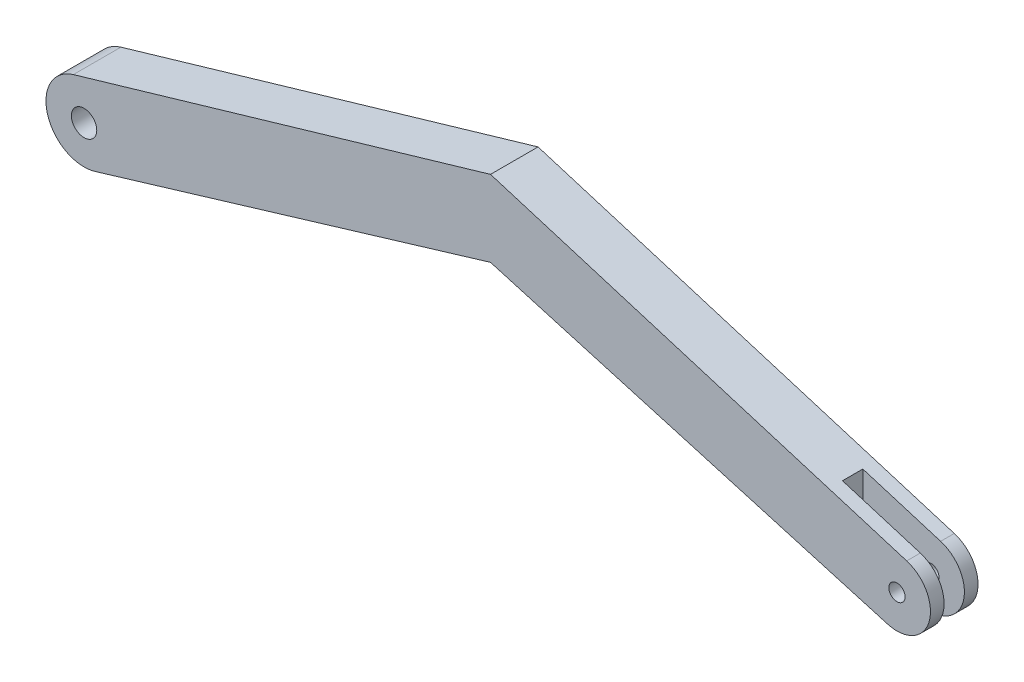
ISO-10303-21;
HEADER;
FILE_DESCRIPTION(('STEP AP214'),'2;1');
FILE_NAME('part.step','',(''),(''),'','','');
FILE_SCHEMA(('AUTOMOTIVE_DESIGN { 1 0 10303 214 1 1 1 1 }'));
ENDSEC;
DATA;
#1=APPLICATION_CONTEXT('core data for automotive mechanical design processes');
#2=APPLICATION_PROTOCOL_DEFINITION('international standard','automotive_design',2000,#1);
#3=PRODUCT_CONTEXT('',#1,'mechanical');
#4=PRODUCT('Part','Part','',(#3));
#5=PRODUCT_RELATED_PRODUCT_CATEGORY('part','',(#4));
#6=PRODUCT_DEFINITION_FORMATION('','',#4);
#7=PRODUCT_DEFINITION_CONTEXT('part definition',#1,'design');
#8=PRODUCT_DEFINITION('design','',#6,#7);
#9=PRODUCT_DEFINITION_SHAPE('','',#8);
#10=(LENGTH_UNIT() NAMED_UNIT(*) SI_UNIT(.MILLI.,.METRE.));
#11=(NAMED_UNIT(*) PLANE_ANGLE_UNIT() SI_UNIT($,.RADIAN.));
#12=(NAMED_UNIT(*) SI_UNIT($,.STERADIAN.) SOLID_ANGLE_UNIT());
#13=UNCERTAINTY_MEASURE_WITH_UNIT(LENGTH_MEASURE(1.E-05),#10,'distance_accuracy_value','');
#14=(GEOMETRIC_REPRESENTATION_CONTEXT(3) GLOBAL_UNCERTAINTY_ASSIGNED_CONTEXT((#13)) GLOBAL_UNIT_ASSIGNED_CONTEXT((#10,
#11,#12)) REPRESENTATION_CONTEXT('',''));
#15=CARTESIAN_POINT('',(0.,0.,0.));
#16=DIRECTION('',(0.,0.,1.));
#17=DIRECTION('',(1.,0.,0.));
#18=AXIS2_PLACEMENT_3D('',#15,#16,#17);
#19=CARTESIAN_POINT('',(0.,0.,2.9718));
#20=DIRECTION('',(0.,0.,-1.));
#21=DIRECTION('',(-1.,0.,0.));
#22=AXIS2_PLACEMENT_3D('',#19,#20,#21);
#23=CYLINDRICAL_SURFACE('',#22,2.0955);
#24=DIRECTION('',(0.,0.,-1.));
#25=VECTOR('',#24,1.);
#26=CARTESIAN_POINT('',(-0.581588951827043,-2.01317523855047,2.9718));
#27=LINE('',#26,#25);
#28=CARTESIAN_POINT('',(-0.581588951827043,-2.01317523855047,2.9718));
#29=VERTEX_POINT('',#28);
#30=CARTESIAN_POINT('',(-0.581588951827043,-2.01317523855047,2.1209));
#31=VERTEX_POINT('',#30);
#32=EDGE_CURVE('E161',#29,#31,#27,.T.);
#33=ORIENTED_EDGE('',*,*,#32,.T.);
#34=CARTESIAN_POINT('',(0.,0.,2.1209));
#35=DIRECTION('',(0.,0.,1.));
#36=DIRECTION('',(1.,0.,0.));
#37=AXIS2_PLACEMENT_3D('',#34,#35,#36);
#38=CIRCLE('',#37,2.0955);
#39=CARTESIAN_POINT('',(0.610010170529957,2.00474632855382,2.1209));
#40=VERTEX_POINT('',#39);
#41=EDGE_CURVE('E192',#31,#40,#38,.T.);
#42=ORIENTED_EDGE('',*,*,#41,.T.);
#43=DIRECTION('',(0.,0.,-1.));
#44=VECTOR('',#43,1.);
#45=CARTESIAN_POINT('',(0.610010170529957,2.00474632855382,2.9718));
#46=LINE('',#45,#44);
#47=CARTESIAN_POINT('',(0.610010170529957,2.00474632855382,2.9718));
#48=VERTEX_POINT('',#47);
#49=EDGE_CURVE('E157',#48,#40,#46,.T.);
#50=ORIENTED_EDGE('',*,*,#49,.F.);
#51=CARTESIAN_POINT('',(0.,0.,2.9718));
#52=DIRECTION('',(0.,0.,1.));
#53=DIRECTION('',(1.,0.,0.));
#54=AXIS2_PLACEMENT_3D('',#51,#52,#53);
#55=CIRCLE('',#54,2.0955);
#56=EDGE_CURVE('E98',#29,#48,#55,.T.);
#57=ORIENTED_EDGE('',*,*,#56,.F.);
#58=EDGE_LOOP('',(#33,#42,#50,#57));
#59=FACE_BOUND('',#58,.T.);
#60=ADVANCED_FACE('F37',(#59),#23,.T.);
#61=CARTESIAN_POINT('',(-0.581588951827043,-2.01317523855047,2.9718));
#62=DIRECTION('',(0.277541852458622,0.96071354738748,0.));
#63=DIRECTION('',(-0.96071354738748,0.277541852458622,0.));
#64=AXIS2_PLACEMENT_3D('',#61,#62,#63);
#65=PLANE('',#64);
#66=DIRECTION('',(0.,0.,1.));
#67=VECTOR('',#66,1.);
#68=CARTESIAN_POINT('',(-4.2545,-0.952102935575522,2.9718));
#69=LINE('',#68,#67);
#70=CARTESIAN_POINT('',(-4.2545,-0.952102935575522,0.8509));
#71=VERTEX_POINT('',#70);
#72=CARTESIAN_POINT('',(-4.2545,-0.952102935575522,2.1209));
#73=VERTEX_POINT('',#72);
#74=EDGE_CURVE('E194',#71,#73,#69,.T.);
#75=ORIENTED_EDGE('',*,*,#74,.T.);
#76=DIRECTION('',(0.96071354738748,-0.277541852458622,0.));
#77=VECTOR('',#76,1.);
#78=CARTESIAN_POINT('',(-0.581588951827043,-2.01317523855047,2.1209));
#79=LINE('',#78,#77);
#80=EDGE_CURVE('E139',#73,#31,#79,.T.);
#81=ORIENTED_EDGE('',*,*,#80,.T.);
#82=ORIENTED_EDGE('',*,*,#32,.F.);
#83=DIRECTION('',(0.96071354738748,-0.277541852458622,0.));
#84=VECTOR('',#83,1.);
#85=CARTESIAN_POINT('',(-0.581588951827043,-2.01317523855047,2.9718));
#86=LINE('',#85,#84);
#87=CARTESIAN_POINT('',(-25.4,5.1566495194336,2.9718));
#88=VERTEX_POINT('',#87);
#89=EDGE_CURVE('E203',#88,#29,#86,.T.);
#90=ORIENTED_EDGE('',*,*,#89,.F.);
#91=DIRECTION('',(0.,0.,-1.));
#92=VECTOR('',#91,1.);
#93=CARTESIAN_POINT('',(-25.4,5.1566495194336,2.9718));
#94=LINE('',#93,#92);
#95=CARTESIAN_POINT('',(-25.4,5.1566495194336,0.));
#96=VERTEX_POINT('',#95);
#97=EDGE_CURVE('E134',#88,#96,#94,.T.);
#98=ORIENTED_EDGE('',*,*,#97,.T.);
#99=DIRECTION('',(0.96071354738748,-0.277541852458622,0.));
#100=VECTOR('',#99,1.);
#101=CARTESIAN_POINT('',(-0.581588951827043,-2.01317523855047,0.));
#102=LINE('',#101,#100);
#103=CARTESIAN_POINT('',(-0.581588951827043,-2.01317523855047,0.));
#104=VERTEX_POINT('',#103);
#105=EDGE_CURVE('E138',#96,#104,#102,.T.);
#106=ORIENTED_EDGE('',*,*,#105,.T.);
#107=CARTESIAN_POINT('',(-0.581588951827043,-2.01317523855047,0.8509));
#108=VERTEX_POINT('',#107);
#109=EDGE_CURVE('E160',#108,#104,#27,.T.);
#110=ORIENTED_EDGE('',*,*,#109,.F.);
#111=DIRECTION('',(-0.96071354738748,0.277541852458622,0.));
#112=VECTOR('',#111,1.);
#113=CARTESIAN_POINT('',(-0.581588951827043,-2.01317523855047,0.8509));
#114=LINE('',#113,#112);
#115=EDGE_CURVE('E197',#108,#71,#114,.T.);
#116=ORIENTED_EDGE('',*,*,#115,.T.);
#117=EDGE_LOOP('',(#75,#81,#82,#90,#98,#106,#110,#116));
#118=FACE_BOUND('',#117,.T.);
#119=ADVANCED_FACE('F206',(#118),#65,.F.);
#120=CARTESIAN_POINT('',(0.610010170529957,2.00474632855382,0.8509));
#121=VERTEX_POINT('',#120);
#122=CARTESIAN_POINT('',(0.610010170529957,2.00474632855382,0.));
#123=VERTEX_POINT('',#122);
#124=EDGE_CURVE('E156',#121,#123,#46,.T.);
#125=ORIENTED_EDGE('',*,*,#124,.F.);
#126=CARTESIAN_POINT('',(0.,0.,0.8509));
#127=DIRECTION('',(0.,0.,-1.));
#128=DIRECTION('',(-1.,0.,0.));
#129=AXIS2_PLACEMENT_3D('',#126,#127,#128);
#130=CIRCLE('',#129,2.0955);
#131=EDGE_CURVE('E53',#121,#108,#130,.T.);
#132=ORIENTED_EDGE('',*,*,#131,.T.);
#133=ORIENTED_EDGE('',*,*,#109,.T.);
#134=CARTESIAN_POINT('',(0.,0.,0.));
#135=DIRECTION('',(0.,0.,1.));
#136=DIRECTION('',(1.,0.,0.));
#137=AXIS2_PLACEMENT_3D('',#134,#135,#136);
#138=CIRCLE('',#137,2.0955);
#139=EDGE_CURVE('E142',#104,#123,#138,.T.);
#140=ORIENTED_EDGE('',*,*,#139,.T.);
#141=EDGE_LOOP('',(#125,#132,#133,#140));
#142=FACE_BOUND('',#141,.T.);
#143=ADVANCED_FACE('F221',(#142),#23,.T.);
#144=CARTESIAN_POINT('',(0.610010170529956,2.00474632855382,2.9718));
#145=DIRECTION('',(0.291104829649227,0.956691161323702,0.));
#146=DIRECTION('',(-0.956691161323702,0.291104829649227,0.));
#147=AXIS2_PLACEMENT_3D('',#144,#145,#146);
#148=PLANE('',#147);
#149=DIRECTION('',(0.956691161323702,-0.291104829649227,0.));
#150=VECTOR('',#149,1.);
#151=CARTESIAN_POINT('',(0.610010170529956,2.00474632855382,2.1209));
#152=LINE('',#151,#150);
#153=CARTESIAN_POINT('',(-4.2545,3.48493393952718,2.1209));
#154=VERTEX_POINT('',#153);
#155=EDGE_CURVE('E11',#154,#40,#152,.T.);
#156=ORIENTED_EDGE('',*,*,#155,.F.);
#157=DIRECTION('',(0.,0.,1.));
#158=VECTOR('',#157,1.);
#159=CARTESIAN_POINT('',(-4.2545,3.48493393952718,2.9718));
#160=LINE('',#159,#158);
#161=CARTESIAN_POINT('',(-4.2545,3.48493393952718,0.8509));
#162=VERTEX_POINT('',#161);
#163=EDGE_CURVE('E46',#162,#154,#160,.T.);
#164=ORIENTED_EDGE('',*,*,#163,.F.);
#165=DIRECTION('',(-0.956691161323702,0.291104829649227,0.));
#166=VECTOR('',#165,1.);
#167=CARTESIAN_POINT('',(0.610010170529956,2.00474632855382,0.8509));
#168=LINE('',#167,#166);
#169=EDGE_CURVE('E163',#121,#162,#168,.T.);
#170=ORIENTED_EDGE('',*,*,#169,.F.);
#171=ORIENTED_EDGE('',*,*,#124,.T.);
#172=DIRECTION('',(0.956691161323703,-0.291104829649227,0.));
#173=VECTOR('',#172,1.);
#174=CARTESIAN_POINT('',(0.610010170529956,2.00474632855382,0.));
#175=LINE('',#174,#173);
#176=CARTESIAN_POINT('',(-25.4,9.9191495194336,0.));
#177=VERTEX_POINT('',#176);
#178=EDGE_CURVE('E145',#177,#123,#175,.T.);
#179=ORIENTED_EDGE('',*,*,#178,.F.);
#180=DIRECTION('',(0.,0.,-1.));
#181=VECTOR('',#180,1.);
#182=CARTESIAN_POINT('',(-25.4,9.9191495194336,2.9718));
#183=LINE('',#182,#181);
#184=CARTESIAN_POINT('',(-25.4,9.9191495194336,2.9718));
#185=VERTEX_POINT('',#184);
#186=EDGE_CURVE('E118',#185,#177,#183,.T.);
#187=ORIENTED_EDGE('',*,*,#186,.F.);
#188=DIRECTION('',(0.956691161323703,-0.291104829649227,0.));
#189=VECTOR('',#188,1.);
#190=CARTESIAN_POINT('',(0.610010170529956,2.00474632855382,2.9718));
#191=LINE('',#190,#189);
#192=EDGE_CURVE('E128',#185,#48,#191,.T.);
#193=ORIENTED_EDGE('',*,*,#192,.T.);
#194=ORIENTED_EDGE('',*,*,#49,.T.);
#195=EDGE_LOOP('',(#156,#164,#170,#171,#179,#187,#193,#194));
#196=FACE_BOUND('',#195,.T.);
#197=ADVANCED_FACE('F191',(#196),#148,.T.);
#198=CARTESIAN_POINT('',(-4.68126240584355,15.986234688874,2.9718));
#199=DIRECTION('',(-0.281029495201368,0.959699131408831,0.));
#200=DIRECTION('',(-0.959699131408831,-0.281029495201368,0.));
#201=AXIS2_PLACEMENT_3D('',#198,#199,#200);
#202=PLANE('',#201);
#203=DIRECTION('',(0.959699131408831,0.281029495201368,0.));
#204=VECTOR('',#203,1.);
#205=CARTESIAN_POINT('',(-4.68126240584355,15.986234688874,0.));
#206=LINE('',#205,#204);
#207=CARTESIAN_POINT('',(-51.4692014854483,2.28528355666728,0.));
#208=VERTEX_POINT('',#207);
#209=EDGE_CURVE('E115',#208,#177,#206,.T.);
#210=ORIENTED_EDGE('',*,*,#209,.F.);
#211=DIRECTION('',(0.,0.,-1.));
#212=VECTOR('',#211,1.);
#213=CARTESIAN_POINT('',(-51.4692014854483,2.28528355666728,2.9718));
#214=LINE('',#213,#212);
#215=CARTESIAN_POINT('',(-51.4692014854483,2.28528355666728,2.9718));
#216=VERTEX_POINT('',#215);
#217=EDGE_CURVE('E109',#216,#208,#214,.T.);
#218=ORIENTED_EDGE('',*,*,#217,.F.);
#219=DIRECTION('',(0.959699131408831,0.281029495201368,0.));
#220=VECTOR('',#219,1.);
#221=CARTESIAN_POINT('',(-4.68126240584355,15.986234688874,2.9718));
#222=LINE('',#221,#220);
#223=EDGE_CURVE('E113',#216,#185,#222,.T.);
#224=ORIENTED_EDGE('',*,*,#223,.T.);
#225=ORIENTED_EDGE('',*,*,#186,.T.);
#226=EDGE_LOOP('',(#210,#218,#224,#225));
#227=FACE_BOUND('',#226,.T.);
#228=ADVANCED_FACE('F111',(#227),#202,.T.);
#229=CARTESIAN_POINT('',(-50.8,0.,2.9718));
#230=DIRECTION('',(0.,0.,-1.));
#231=DIRECTION('',(-1.,0.,0.));
#232=AXIS2_PLACEMENT_3D('',#229,#230,#231);
#233=CYLINDRICAL_SURFACE('',#232,2.38125);
#234=CARTESIAN_POINT('',(-50.8,0.,0.));
#235=DIRECTION('',(0.,0.,1.));
#236=DIRECTION('',(1.,0.,0.));
#237=AXIS2_PLACEMENT_3D('',#234,#235,#236);
#238=CIRCLE('',#237,2.38125);
#239=CARTESIAN_POINT('',(-50.1138276425447,-2.28024539433024,0.));
#240=VERTEX_POINT('',#239);
#241=EDGE_CURVE('E149',#208,#240,#238,.T.);
#242=ORIENTED_EDGE('',*,*,#241,.T.);
#243=DIRECTION('',(0.,0.,-1.));
#244=VECTOR('',#243,1.);
#245=CARTESIAN_POINT('',(-50.1138276425447,-2.28024539433024,2.9718));
#246=LINE('',#245,#244);
#247=CARTESIAN_POINT('',(-50.1138276425447,-2.28024539433024,2.9718));
#248=VERTEX_POINT('',#247);
#249=EDGE_CURVE('E119',#248,#240,#246,.T.);
#250=ORIENTED_EDGE('',*,*,#249,.F.);
#251=CARTESIAN_POINT('',(-50.8,0.,2.9718));
#252=DIRECTION('',(0.,0.,1.));
#253=DIRECTION('',(1.,0.,0.));
#254=AXIS2_PLACEMENT_3D('',#251,#252,#253);
#255=CIRCLE('',#254,2.38125);
#256=EDGE_CURVE('E122',#216,#248,#255,.T.);
#257=ORIENTED_EDGE('',*,*,#256,.F.);
#258=ORIENTED_EDGE('',*,*,#217,.T.);
#259=EDGE_LOOP('',(#242,#250,#257,#258));
#260=FACE_BOUND('',#259,.T.);
#261=ADVANCED_FACE('F123',(#260),#233,.T.);
#262=CARTESIAN_POINT('',(-50.8,0.,2.9718));
#263=DIRECTION('',(0.,0.,-1.));
#264=DIRECTION('',(-1.,0.,0.));
#265=AXIS2_PLACEMENT_3D('',#262,#263,#264);
#266=CYLINDRICAL_SURFACE('',#265,0.79375);
#267=CARTESIAN_POINT('',(-50.8,0.,2.9718));
#268=DIRECTION('',(0.,0.,1.));
#269=DIRECTION('',(1.,0.,0.));
#270=AXIS2_PLACEMENT_3D('',#267,#268,#269);
#271=CIRCLE('',#270,0.79375);
#272=CARTESIAN_POINT('',(-50.00625,0.,2.9718));
#273=VERTEX_POINT('',#272);
#274=EDGE_CURVE('E152',#273,#273,#271,.T.);
#275=ORIENTED_EDGE('',*,*,#274,.T.);
#276=EDGE_LOOP('',(#275));
#277=FACE_BOUND('',#276,.T.);
#278=CARTESIAN_POINT('',(-50.8,0.,0.));
#279=DIRECTION('',(0.,0.,1.));
#280=DIRECTION('',(1.,0.,0.));
#281=AXIS2_PLACEMENT_3D('',#278,#279,#280);
#282=CIRCLE('',#281,0.79375);
#283=CARTESIAN_POINT('',(-50.00625,0.,0.));
#284=VERTEX_POINT('',#283);
#285=EDGE_CURVE('E135',#284,#284,#282,.T.);
#286=ORIENTED_EDGE('',*,*,#285,.F.);
#287=EDGE_LOOP('',(#286));
#288=FACE_BOUND('',#287,.T.);
#289=ADVANCED_FACE('F39',(#277,#288),#266,.F.);
#290=CARTESIAN_POINT('',(-3.53195961310443,11.7371889922961,2.9718));
#291=DIRECTION('',(-0.288156370584888,0.95758336769774,0.));
#292=DIRECTION('',(-0.95758336769774,-0.288156370584888,0.));
#293=AXIS2_PLACEMENT_3D('',#290,#291,#292);
#294=PLANE('',#293);
#295=DIRECTION('',(0.95758336769774,0.288156370584888,0.));
#296=VECTOR('',#295,1.);
#297=CARTESIAN_POINT('',(-3.53195961310443,11.7371889922961,0.));
#298=LINE('',#297,#296);
#299=EDGE_CURVE('E89',#240,#96,#298,.T.);
#300=ORIENTED_EDGE('',*,*,#299,.T.);
#301=ORIENTED_EDGE('',*,*,#97,.F.);
#302=DIRECTION('',(0.95758336769774,0.288156370584888,0.));
#303=VECTOR('',#302,1.);
#304=CARTESIAN_POINT('',(-3.53195961310443,11.7371889922961,2.9718));
#305=LINE('',#304,#303);
#306=EDGE_CURVE('E62',#248,#88,#305,.T.);
#307=ORIENTED_EDGE('',*,*,#306,.F.);
#308=ORIENTED_EDGE('',*,*,#249,.T.);
#309=EDGE_LOOP('',(#300,#301,#307,#308));
#310=FACE_BOUND('',#309,.T.);
#311=ADVANCED_FACE('F228',(#310),#294,.F.);
#312=CARTESIAN_POINT('',(0.,0.,2.9718));
#313=DIRECTION('',(0.,0.,1.));
#314=DIRECTION('',(1.,0.,0.));
#315=AXIS2_PLACEMENT_3D('',#312,#313,#314);
#316=PLANE('',#315);
#317=CARTESIAN_POINT('',(0.,0.,2.9718));
#318=DIRECTION('',(0.,0.,1.));
#319=DIRECTION('',(1.,0.,0.));
#320=AXIS2_PLACEMENT_3D('',#317,#318,#319);
#321=CIRCLE('',#320,0.508);
#322=CARTESIAN_POINT('',(0.508,0.,2.9718));
#323=VERTEX_POINT('',#322);
#324=EDGE_CURVE('E352',#323,#323,#321,.T.);
#325=ORIENTED_EDGE('',*,*,#324,.F.);
#326=EDGE_LOOP('',(#325));
#327=FACE_BOUND('',#326,.T.);
#328=ORIENTED_EDGE('',*,*,#274,.F.);
#329=EDGE_LOOP('',(#328));
#330=FACE_BOUND('',#329,.T.);
#331=ORIENTED_EDGE('',*,*,#89,.T.);
#332=ORIENTED_EDGE('',*,*,#56,.T.);
#333=ORIENTED_EDGE('',*,*,#192,.F.);
#334=ORIENTED_EDGE('',*,*,#223,.F.);
#335=ORIENTED_EDGE('',*,*,#256,.T.);
#336=ORIENTED_EDGE('',*,*,#306,.T.);
#337=EDGE_LOOP('',(#331,#332,#333,#334,#335,#336));
#338=FACE_BOUND('',#337,.T.);
#339=ADVANCED_FACE('F126',(#327,#330,#338),#316,.T.);
#340=CARTESIAN_POINT('',(0.,0.,0.));
#341=DIRECTION('',(0.,0.,1.));
#342=DIRECTION('',(1.,0.,0.));
#343=AXIS2_PLACEMENT_3D('',#340,#341,#342);
#344=PLANE('',#343);
#345=CARTESIAN_POINT('',(0.,0.,0.));
#346=DIRECTION('',(0.,0.,1.));
#347=DIRECTION('',(1.,0.,0.));
#348=AXIS2_PLACEMENT_3D('',#345,#346,#347);
#349=CIRCLE('',#348,0.508);
#350=CARTESIAN_POINT('',(0.508,0.,0.));
#351=VERTEX_POINT('',#350);
#352=EDGE_CURVE('E354',#351,#351,#349,.T.);
#353=ORIENTED_EDGE('',*,*,#352,.T.);
#354=EDGE_LOOP('',(#353));
#355=FACE_BOUND('',#354,.T.);
#356=ORIENTED_EDGE('',*,*,#285,.T.);
#357=EDGE_LOOP('',(#356));
#358=FACE_BOUND('',#357,.T.);
#359=ORIENTED_EDGE('',*,*,#105,.F.);
#360=ORIENTED_EDGE('',*,*,#299,.F.);
#361=ORIENTED_EDGE('',*,*,#241,.F.);
#362=ORIENTED_EDGE('',*,*,#209,.T.);
#363=ORIENTED_EDGE('',*,*,#178,.T.);
#364=ORIENTED_EDGE('',*,*,#139,.F.);
#365=EDGE_LOOP('',(#359,#360,#361,#362,#363,#364));
#366=FACE_BOUND('',#365,.T.);
#367=ADVANCED_FACE('F226',(#355,#358,#366),#344,.F.);
#368=CARTESIAN_POINT('',(-4.2545,-2.38125,2.1209));
#369=DIRECTION('',(0.,0.,1.));
#370=DIRECTION('',(1.,0.,0.));
#371=AXIS2_PLACEMENT_3D('',#368,#369,#370);
#372=PLANE('',#371);
#373=CARTESIAN_POINT('',(0.,0.,2.1209));
#374=DIRECTION('',(0.,0.,1.));
#375=DIRECTION('',(1.,0.,0.));
#376=AXIS2_PLACEMENT_3D('',#373,#374,#375);
#377=CIRCLE('',#376,0.508);
#378=CARTESIAN_POINT('',(0.508,0.,2.1209));
#379=VERTEX_POINT('',#378);
#380=EDGE_CURVE('E214',#379,#379,#377,.F.);
#381=ORIENTED_EDGE('',*,*,#380,.F.);
#382=EDGE_LOOP('',(#381));
#383=FACE_BOUND('',#382,.T.);
#384=DIRECTION('',(0.,1.,0.));
#385=VECTOR('',#384,1.);
#386=CARTESIAN_POINT('',(-4.2545,-2.38125,2.1209));
#387=LINE('',#386,#385);
#388=EDGE_CURVE('E175',#73,#154,#387,.T.);
#389=ORIENTED_EDGE('',*,*,#388,.T.);
#390=ORIENTED_EDGE('',*,*,#155,.T.);
#391=ORIENTED_EDGE('',*,*,#41,.F.);
#392=ORIENTED_EDGE('',*,*,#80,.F.);
#393=EDGE_LOOP('',(#389,#390,#391,#392));
#394=FACE_BOUND('',#393,.T.);
#395=ADVANCED_FACE('F186',(#383,#394),#372,.F.);
#396=CARTESIAN_POINT('',(-4.2545,-2.38125,2.1209));
#397=DIRECTION('',(-1.,0.,0.));
#398=DIRECTION('',(0.,0.,1.));
#399=AXIS2_PLACEMENT_3D('',#396,#397,#398);
#400=PLANE('',#399);
#401=DIRECTION('',(0.,1.,0.));
#402=VECTOR('',#401,1.);
#403=CARTESIAN_POINT('',(-4.2545,-2.38125,0.8509));
#404=LINE('',#403,#402);
#405=EDGE_CURVE('E179',#71,#162,#404,.T.);
#406=ORIENTED_EDGE('',*,*,#405,.T.);
#407=ORIENTED_EDGE('',*,*,#163,.T.);
#408=ORIENTED_EDGE('',*,*,#388,.F.);
#409=ORIENTED_EDGE('',*,*,#74,.F.);
#410=EDGE_LOOP('',(#406,#407,#408,#409));
#411=FACE_BOUND('',#410,.T.);
#412=ADVANCED_FACE('F172',(#411),#400,.F.);
#413=CARTESIAN_POINT('',(-4.2545,-2.38125,0.8509));
#414=DIRECTION('',(0.,0.,-1.));
#415=DIRECTION('',(-1.,0.,0.));
#416=AXIS2_PLACEMENT_3D('',#413,#414,#415);
#417=PLANE('',#416);
#418=CARTESIAN_POINT('',(0.,0.,0.8509));
#419=DIRECTION('',(0.,0.,-1.));
#420=DIRECTION('',(-1.,0.,0.));
#421=AXIS2_PLACEMENT_3D('',#418,#419,#420);
#422=CIRCLE('',#421,0.508);
#423=CARTESIAN_POINT('',(-0.508,0.,0.8509));
#424=VERTEX_POINT('',#423);
#425=EDGE_CURVE('E41',#424,#424,#422,.F.);
#426=ORIENTED_EDGE('',*,*,#425,.F.);
#427=EDGE_LOOP('',(#426));
#428=FACE_BOUND('',#427,.T.);
#429=ORIENTED_EDGE('',*,*,#131,.F.);
#430=ORIENTED_EDGE('',*,*,#169,.T.);
#431=ORIENTED_EDGE('',*,*,#405,.F.);
#432=ORIENTED_EDGE('',*,*,#115,.F.);
#433=EDGE_LOOP('',(#429,#430,#431,#432));
#434=FACE_BOUND('',#433,.T.);
#435=ADVANCED_FACE('F213',(#428,#434),#417,.F.);
#436=CARTESIAN_POINT('',(0.,0.,2.9718));
#437=DIRECTION('',(0.,0.,-1.));
#438=DIRECTION('',(-1.,0.,0.));
#439=AXIS2_PLACEMENT_3D('',#436,#437,#438);
#440=CYLINDRICAL_SURFACE('',#439,0.508);
#441=ORIENTED_EDGE('',*,*,#352,.F.);
#442=EDGE_LOOP('',(#441));
#443=FACE_BOUND('',#442,.T.);
#444=ORIENTED_EDGE('',*,*,#425,.T.);
#445=EDGE_LOOP('',(#444));
#446=FACE_BOUND('',#445,.T.);
#447=ADVANCED_FACE('F326',(#443,#446),#440,.F.);
#448=ORIENTED_EDGE('',*,*,#324,.T.);
#449=EDGE_LOOP('',(#448));
#450=FACE_BOUND('',#449,.T.);
#451=ORIENTED_EDGE('',*,*,#380,.T.);
#452=EDGE_LOOP('',(#451));
#453=FACE_BOUND('',#452,.T.);
#454=ADVANCED_FACE('F336',(#450,#453),#440,.F.);
#455=CLOSED_SHELL('',(#60,#119,#143,#197,#228,#261,#289,#311,#339,#367,#395,#412,#435,#447,#454));
#456=MANIFOLD_SOLID_BREP('B2',#455);
#457=ADVANCED_BREP_SHAPE_REPRESENTATION('',(#18,#456),#14);
#458=SHAPE_DEFINITION_REPRESENTATION(#9,#457);
ENDSEC;
END-ISO-10303-21;
